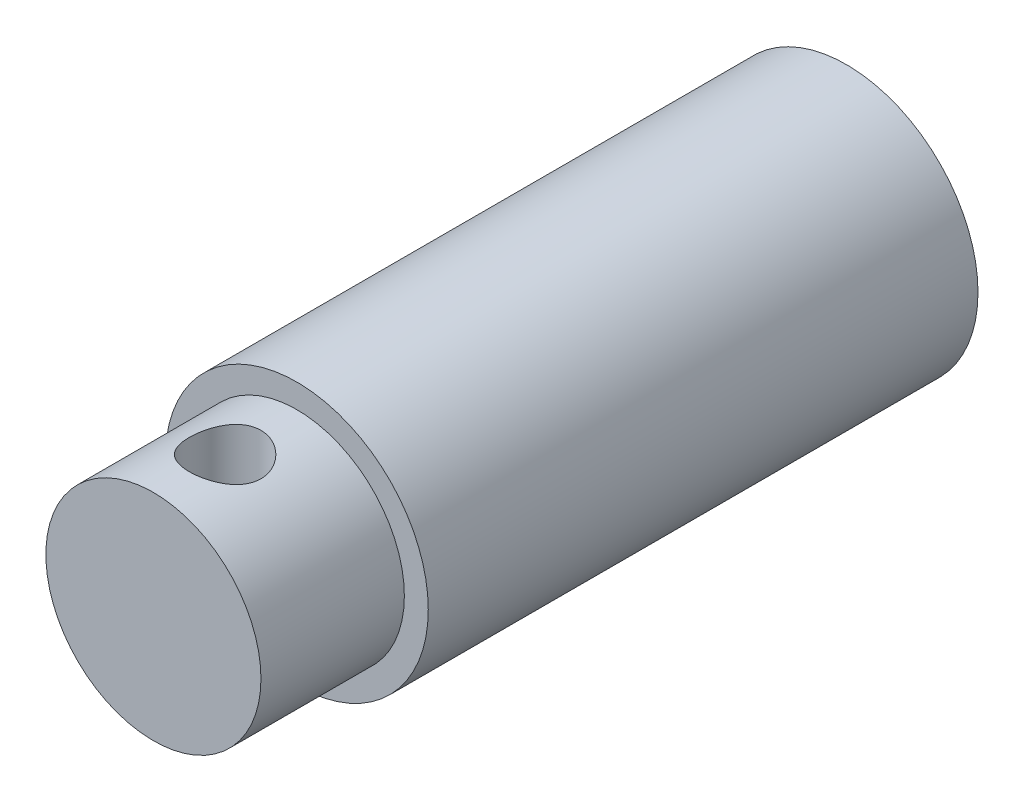
ISO-10303-21;
HEADER;
FILE_DESCRIPTION(('STEP AP214'),'2;1');
FILE_NAME('part.step','',(''),(''),'','','');
FILE_SCHEMA(('AUTOMOTIVE_DESIGN { 1 0 10303 214 1 1 1 1 }'));
ENDSEC;
DATA;
#1=APPLICATION_CONTEXT('core data for automotive mechanical design processes');
#2=APPLICATION_PROTOCOL_DEFINITION('international standard','automotive_design',2000,#1);
#3=PRODUCT_CONTEXT('',#1,'mechanical');
#4=PRODUCT('Part','Part','',(#3));
#5=PRODUCT_RELATED_PRODUCT_CATEGORY('part','',(#4));
#6=PRODUCT_DEFINITION_FORMATION('','',#4);
#7=PRODUCT_DEFINITION_CONTEXT('part definition',#1,'design');
#8=PRODUCT_DEFINITION('design','',#6,#7);
#9=PRODUCT_DEFINITION_SHAPE('','',#8);
#10=(LENGTH_UNIT() NAMED_UNIT(*) SI_UNIT(.MILLI.,.METRE.));
#11=(NAMED_UNIT(*) PLANE_ANGLE_UNIT() SI_UNIT($,.RADIAN.));
#12=(NAMED_UNIT(*) SI_UNIT($,.STERADIAN.) SOLID_ANGLE_UNIT());
#13=UNCERTAINTY_MEASURE_WITH_UNIT(LENGTH_MEASURE(1.E-05),#10,'distance_accuracy_value','');
#14=(GEOMETRIC_REPRESENTATION_CONTEXT(3) GLOBAL_UNCERTAINTY_ASSIGNED_CONTEXT((#13)) GLOBAL_UNIT_ASSIGNED_CONTEXT((#10,
#11,#12)) REPRESENTATION_CONTEXT('',''));
#15=CARTESIAN_POINT('',(0.,0.,0.));
#16=DIRECTION('',(0.,0.,1.));
#17=DIRECTION('',(1.,0.,0.));
#18=AXIS2_PLACEMENT_3D('',#15,#16,#17);
#19=CARTESIAN_POINT('',(0.,0.,23.));
#20=DIRECTION('',(0.,0.,-1.));
#21=DIRECTION('',(-1.,0.,0.));
#22=AXIS2_PLACEMENT_3D('',#19,#20,#21);
#23=CYLINDRICAL_SURFACE('',#22,5.5);
#24=CARTESIAN_POINT('',(0.,0.,23.));
#25=DIRECTION('',(0.,0.,1.));
#26=DIRECTION('',(1.,0.,0.));
#27=AXIS2_PLACEMENT_3D('',#24,#25,#26);
#28=CIRCLE('',#27,5.5);
#29=CARTESIAN_POINT('',(5.5,0.,23.));
#30=VERTEX_POINT('',#29);
#31=EDGE_CURVE('E49',#30,#30,#28,.T.);
#32=ORIENTED_EDGE('',*,*,#31,.F.);
#33=EDGE_LOOP('',(#32));
#34=FACE_BOUND('',#33,.T.);
#35=CARTESIAN_POINT('',(0.,0.,0.));
#36=DIRECTION('',(0.,0.,1.));
#37=DIRECTION('',(1.,0.,0.));
#38=AXIS2_PLACEMENT_3D('',#35,#36,#37);
#39=CIRCLE('',#38,5.5);
#40=CARTESIAN_POINT('',(5.5,0.,0.));
#41=VERTEX_POINT('',#40);
#42=EDGE_CURVE('E54',#41,#41,#39,.T.);
#43=ORIENTED_EDGE('',*,*,#42,.T.);
#44=EDGE_LOOP('',(#43));
#45=FACE_BOUND('',#44,.T.);
#46=ADVANCED_FACE('F37',(#34,#45),#23,.T.);
#47=CARTESIAN_POINT('',(0.,0.,23.));
#48=DIRECTION('',(0.,0.,1.));
#49=DIRECTION('',(1.,0.,0.));
#50=AXIS2_PLACEMENT_3D('',#47,#48,#49);
#51=PLANE('',#50);
#52=CARTESIAN_POINT('',(0.,0.,23.));
#53=DIRECTION('',(0.,0.,1.));
#54=DIRECTION('',(1.,0.,0.));
#55=AXIS2_PLACEMENT_3D('',#52,#53,#54);
#56=CIRCLE('',#55,4.5);
#57=CARTESIAN_POINT('',(4.5,0.,23.));
#58=VERTEX_POINT('',#57);
#59=EDGE_CURVE('E10',#58,#58,#56,.T.);
#60=ORIENTED_EDGE('',*,*,#59,.F.);
#61=EDGE_LOOP('',(#60));
#62=FACE_BOUND('',#61,.T.);
#63=ORIENTED_EDGE('',*,*,#31,.T.);
#64=EDGE_LOOP('',(#63));
#65=FACE_BOUND('',#64,.T.);
#66=ADVANCED_FACE('F85',(#62,#65),#51,.T.);
#67=CARTESIAN_POINT('',(0.,0.,0.));
#68=DIRECTION('',(0.,0.,1.));
#69=DIRECTION('',(1.,0.,0.));
#70=AXIS2_PLACEMENT_3D('',#67,#68,#69);
#71=PLANE('',#70);
#72=ORIENTED_EDGE('',*,*,#42,.F.);
#73=EDGE_LOOP('',(#72));
#74=FACE_BOUND('',#73,.T.);
#75=ADVANCED_FACE('F81',(#74),#71,.F.);
#76=CARTESIAN_POINT('',(0.,0.,29.));
#77=DIRECTION('',(0.,0.,-1.));
#78=DIRECTION('',(-1.,0.,0.));
#79=AXIS2_PLACEMENT_3D('',#76,#77,#78);
#80=CYLINDRICAL_SURFACE('',#79,4.5);
#81=CARTESIAN_POINT('',(0.,-4.5,27.5));
#82=CARTESIAN_POINT('',(0.0818450443300851,-4.50000022951416,27.5000003805975));
#83=CARTESIAN_POINT('',(0.163687791807825,-4.49774654261317,27.4932796008092));
#84=CARTESIAN_POINT('',(0.324962641309459,-4.48897815304921,27.4666563367742));
#85=CARTESIAN_POINT('',(0.404394492178227,-4.48246300803229,27.4467524840766));
#86=CARTESIAN_POINT('',(0.558499184252665,-4.46587961859664,27.3945211349239));
#87=CARTESIAN_POINT('',(0.633179738829052,-4.4558173159628,27.3622144063111));
#88=CARTESIAN_POINT('',(0.776062405207988,-4.43316668576013,27.2861882407425));
#89=CARTESIAN_POINT('',(0.844263235438059,-4.42057786001667,27.2424665524961));
#90=CARTESIAN_POINT('',(0.9746125125334,-4.39371141664507,27.1432612927119));
#91=CARTESIAN_POINT('',(1.03650555044746,-4.37939334695677,27.0874531486093));
#92=CARTESIAN_POINT('',(1.15024903905313,-4.35090472174682,26.9663492679401));
#93=CARTESIAN_POINT('',(1.20209727823419,-4.33673419935824,26.9010514476072));
#94=CARTESIAN_POINT('',(1.29573741334179,-4.30969998715911,26.7605223272053));
#95=CARTESIAN_POINT('',(1.33719728733155,-4.29688558913532,26.6850593904018));
#96=CARTESIAN_POINT('',(1.40672831081658,-4.27462958127902,26.5277358583122));
#97=CARTESIAN_POINT('',(1.43480354608015,-4.26518694241118,26.4458772242559));
#98=CARTESIAN_POINT('',(1.47581019226375,-4.25116954904066,26.2809901677549));
#99=CARTESIAN_POINT('',(1.48922017240766,-4.24644143654417,26.1980941872664));
#100=CARTESIAN_POINT('',(1.50201168500172,-4.24193484944261,26.0311043687662));
#101=CARTESIAN_POINT('',(1.50139755240708,-4.24215484534095,25.9470109089362));
#102=CARTESIAN_POINT('',(1.48652985555513,-4.2473852251227,25.784095054334));
#103=CARTESIAN_POINT('',(1.47290086975049,-4.25217623801299,25.7052073956215));
#104=CARTESIAN_POINT('',(1.43340924427413,-4.26564986586826,25.5509098705897));
#105=CARTESIAN_POINT('',(1.40754513988781,-4.27433294676161,25.4755004218474));
#106=CARTESIAN_POINT('',(1.34390858709032,-4.29476866696873,25.3288808756128));
#107=CARTESIAN_POINT('',(1.30595107306089,-4.30656848689676,25.2577579617957));
#108=CARTESIAN_POINT('',(1.21933365945471,-4.3318883786359,25.1226936375804));
#109=CARTESIAN_POINT('',(1.17067066854601,-4.34540894685695,25.0587543095999));
#110=CARTESIAN_POINT('',(1.06102399902336,-4.37350993751611,24.9363626027588));
#111=CARTESIAN_POINT('',(0.999529725114468,-4.38810884032264,24.8783709582364));
#112=CARTESIAN_POINT('',(0.867509354955096,-4.41610407580555,24.7734031000049));
#113=CARTESIAN_POINT('',(0.79698239349122,-4.42950029307101,24.7264279427533));
#114=CARTESIAN_POINT('',(0.647921419569399,-4.4537566190669,24.6444555496474));
#115=CARTESIAN_POINT('',(0.569314914624503,-4.46459025012059,24.6095817629889));
#116=CARTESIAN_POINT('',(0.40690362504676,-4.48230850716652,24.5536952390664));
#117=CARTESIAN_POINT('',(0.323100657232428,-4.48919450482319,24.5326776868648));
#118=CARTESIAN_POINT('',(0.156575744293954,-4.49801440607161,24.5059165009665));
#119=CARTESIAN_POINT('',(0.0739643997972672,-4.50015002750592,24.4995502862409));
#120=CARTESIAN_POINT('',(-0.0911626049403577,-4.49983354042241,24.5004990103977));
#121=CARTESIAN_POINT('',(-0.173678278979477,-4.49738220629043,24.5078116399698));
#122=CARTESIAN_POINT('',(-0.333779799456385,-4.48830037075656,24.5354178616039));
#123=CARTESIAN_POINT('',(-0.411439210252267,-4.48179298066788,24.5553293090742));
#124=CARTESIAN_POINT('',(-0.562283937869362,-4.46537770245105,24.6070901667001));
#125=CARTESIAN_POINT('',(-0.635468682762912,-4.45546938070013,24.6389410992017));
#126=CARTESIAN_POINT('',(-0.777432444589911,-4.43293396930935,24.7146056477612));
#127=CARTESIAN_POINT('',(-0.846044938825722,-4.42024222133679,24.7587118899248));
#128=CARTESIAN_POINT('',(-0.975097245203381,-4.39357880874393,24.8572912250202));
#129=CARTESIAN_POINT('',(-1.03553455169337,-4.37960675390741,24.9117674840476));
#130=CARTESIAN_POINT('',(-1.14937876170945,-4.35115271970667,25.0324681265099));
#131=CARTESIAN_POINT('',(-1.20234145386866,-4.33667641631142,25.0991138403903));
#132=CARTESIAN_POINT('',(-1.29638628348536,-4.30949959942063,25.2406573517163));
#133=CARTESIAN_POINT('',(-1.33746832189652,-4.29679910073003,25.3155552179511));
#134=CARTESIAN_POINT('',(-1.40639539562454,-4.27473587687075,25.4715095229348));
#135=CARTESIAN_POINT('',(-1.43426719824753,-4.26536641189468,25.5525531187531));
#136=CARTESIAN_POINT('',(-1.47584200013904,-4.25116248459674,25.7185679750662));
#137=CARTESIAN_POINT('',(-1.48955138243091,-4.24632597935459,25.8035374481065));
#138=CARTESIAN_POINT('',(-1.50191442371601,-4.24196788311266,25.9702956440614));
#139=CARTESIAN_POINT('',(-1.5013053859626,-4.24218600386123,26.0520235104302));
#140=CARTESIAN_POINT('',(-1.48686344017304,-4.24726904735801,26.2141476123831));
#141=CARTESIAN_POINT('',(-1.47303131918788,-4.25213369354042,26.2945439269326));
#142=CARTESIAN_POINT('',(-1.43305771969402,-4.26576786457337,26.4502034945037));
#143=CARTESIAN_POINT('',(-1.40715501902327,-4.27446147033716,26.5255352375067));
#144=CARTESIAN_POINT('',(-1.34396904863962,-4.29474598227703,26.6708411104074));
#145=CARTESIAN_POINT('',(-1.30668325283071,-4.3063375314509,26.740814046782));
#146=CARTESIAN_POINT('',(-1.21989103887514,-4.33174243839069,26.8767255048844));
#147=CARTESIAN_POINT('',(-1.16992236414687,-4.34563067463206,26.9423547528476));
#148=CARTESIAN_POINT('',(-1.05996432470347,-4.37375034424879,27.0645347200763));
#149=CARTESIAN_POINT('',(-0.999972126677222,-4.38798187368558,27.1210828635321));
#150=CARTESIAN_POINT('',(-0.868862335381033,-4.41585045788316,27.2257166184338));
#151=CARTESIAN_POINT('',(-0.797402270249593,-4.42944272701885,27.2733865216265));
#152=CARTESIAN_POINT('',(-0.647036036109936,-4.45388986758918,27.355985643276));
#153=CARTESIAN_POINT('',(-0.568131777198522,-4.46474543861895,27.3909181188831));
#154=CARTESIAN_POINT('',(-0.408740470801463,-4.48208272602813,27.445582448733));
#155=CARTESIAN_POINT('',(-0.328481636514612,-4.48873818633784,27.4659236993951));
#156=CARTESIAN_POINT('',(-0.16548062401537,-4.49769610596333,27.4931304210157));
#157=CARTESIAN_POINT('',(-0.0827391383531192,-4.49999976797857,27.4999996152448));
#158=CARTESIAN_POINT('',(0.,-4.5,27.5));
#159=B_SPLINE_CURVE_WITH_KNOTS('',3,(#81,#82,#83,#84,#85,#86,#87,#88,#89,#90,#91,#92,#93,#94,
#95,#96,#97,#98,#99,#100,#101,#102,#103,#104,#105,#106,#107,#108,#109,#110,#111,#112,#113,#114,
#115,#116,#117,#118,#119,#120,#121,#122,#123,#124,#125,#126,#127,#128,#129,#130,#131,#132,#133,
#134,#135,#136,#137,#138,#139,#140,#141,#142,#143,#144,#145,#146,#147,#148,#149,#150,#151,#152,
#153,#154,#155,#156,#157,#158),.UNSPECIFIED.,.T.,.F.,(4,2,2,2,2,2,2,2,2,2,2,2,2,2,2,2,2,2,2,2,2,
2,2,2,2,2,2,2,2,2,2,2,2,2,2,2,2,2,4),(0.,0.245230659039017,0.490486777901282,0.735334009305412,
0.980229566698651,1.23277026424134,1.48536649931295,1.74522577235206,2.0050056703925,
2.25602888612761,2.50697450981229,2.7464523982692,2.98595896283223,3.22932256732696,
3.47275653837311,3.72889958717051,3.98506718949928,4.24377608475537,4.50239503315813,
4.74980374762755,4.99717069746265,5.23737236967321,5.47760467926156,5.72415599765605,
5.97078271232837,6.22861534321128,6.48645012352496,6.74376020740156,7.00095427058761,
7.24493499096388,7.48890119027064,7.72823380620628,7.96761957263968,8.21745100037708,
8.46735316685669,8.72699491252652,8.98657021728686,9.23454837560722,9.48245799057211),.UNSPECIFIED.);
#160=CARTESIAN_POINT('',(0.,-4.5,27.5));
#161=VERTEX_POINT('',#160);
#162=EDGE_CURVE('E40',#161,#161,#159,.T.);
#163=ORIENTED_EDGE('',*,*,#162,.T.);
#164=EDGE_LOOP('',(#163));
#165=FACE_BOUND('',#164,.T.);
#166=CARTESIAN_POINT('',(0.,4.5,27.5));
#167=CARTESIAN_POINT('',(-0.0818450443300851,4.50000022951416,27.5000003805975));
#168=CARTESIAN_POINT('',(-0.163687791807825,4.49774654261317,27.4932796008092));
#169=CARTESIAN_POINT('',(-0.324962641309459,4.48897815304921,27.4666563367742));
#170=CARTESIAN_POINT('',(-0.404394492178227,4.48246300803229,27.4467524840766));
#171=CARTESIAN_POINT('',(-0.558499184252665,4.46587961859664,27.3945211349239));
#172=CARTESIAN_POINT('',(-0.633179738829052,4.4558173159628,27.3622144063111));
#173=CARTESIAN_POINT('',(-0.776062405207988,4.43316668576013,27.2861882407425));
#174=CARTESIAN_POINT('',(-0.844263235438059,4.42057786001667,27.2424665524961));
#175=CARTESIAN_POINT('',(-0.9746125125334,4.39371141664507,27.1432612927119));
#176=CARTESIAN_POINT('',(-1.03650555044746,4.37939334695677,27.0874531486093));
#177=CARTESIAN_POINT('',(-1.15024903905313,4.35090472174682,26.9663492679401));
#178=CARTESIAN_POINT('',(-1.20209727823419,4.33673419935824,26.9010514476072));
#179=CARTESIAN_POINT('',(-1.29573741334179,4.30969998715911,26.7605223272053));
#180=CARTESIAN_POINT('',(-1.33719728733155,4.29688558913532,26.6850593904018));
#181=CARTESIAN_POINT('',(-1.40672831081658,4.27462958127902,26.5277358583122));
#182=CARTESIAN_POINT('',(-1.43480354608015,4.26518694241118,26.4458772242559));
#183=CARTESIAN_POINT('',(-1.47581019226375,4.25116954904066,26.2809901677549));
#184=CARTESIAN_POINT('',(-1.48922017240766,4.24644143654417,26.1980941872664));
#185=CARTESIAN_POINT('',(-1.50201168500172,4.24193484944261,26.0311043687662));
#186=CARTESIAN_POINT('',(-1.50139755240708,4.24215484534095,25.9470109089362));
#187=CARTESIAN_POINT('',(-1.48652985555513,4.2473852251227,25.784095054334));
#188=CARTESIAN_POINT('',(-1.47290086975049,4.25217623801299,25.7052073956215));
#189=CARTESIAN_POINT('',(-1.43340924427413,4.26564986586826,25.5509098705897));
#190=CARTESIAN_POINT('',(-1.40754513988781,4.27433294676161,25.4755004218474));
#191=CARTESIAN_POINT('',(-1.34390858709032,4.29476866696873,25.3288808756128));
#192=CARTESIAN_POINT('',(-1.30595107306089,4.30656848689676,25.2577579617957));
#193=CARTESIAN_POINT('',(-1.21933365945471,4.3318883786359,25.1226936375804));
#194=CARTESIAN_POINT('',(-1.17067066854601,4.34540894685695,25.0587543095999));
#195=CARTESIAN_POINT('',(-1.06102399902336,4.37350993751611,24.9363626027588));
#196=CARTESIAN_POINT('',(-0.999529725114468,4.38810884032264,24.8783709582364));
#197=CARTESIAN_POINT('',(-0.867509354955096,4.41610407580555,24.7734031000049));
#198=CARTESIAN_POINT('',(-0.79698239349122,4.42950029307101,24.7264279427533));
#199=CARTESIAN_POINT('',(-0.647921419569399,4.4537566190669,24.6444555496474));
#200=CARTESIAN_POINT('',(-0.569314914624503,4.46459025012059,24.6095817629889));
#201=CARTESIAN_POINT('',(-0.40690362504676,4.48230850716652,24.5536952390664));
#202=CARTESIAN_POINT('',(-0.323100657232428,4.48919450482319,24.5326776868648));
#203=CARTESIAN_POINT('',(-0.156575744293954,4.49801440607161,24.5059165009665));
#204=CARTESIAN_POINT('',(-0.0739643997972672,4.50015002750592,24.4995502862409));
#205=CARTESIAN_POINT('',(0.0911626049403577,4.49983354042241,24.5004990103977));
#206=CARTESIAN_POINT('',(0.173678278979477,4.49738220629043,24.5078116399698));
#207=CARTESIAN_POINT('',(0.333779799456385,4.48830037075656,24.5354178616039));
#208=CARTESIAN_POINT('',(0.411439210252267,4.48179298066788,24.5553293090742));
#209=CARTESIAN_POINT('',(0.562283937869362,4.46537770245105,24.6070901667001));
#210=CARTESIAN_POINT('',(0.635468682762912,4.45546938070013,24.6389410992017));
#211=CARTESIAN_POINT('',(0.777432444589911,4.43293396930935,24.7146056477612));
#212=CARTESIAN_POINT('',(0.846044938825722,4.42024222133679,24.7587118899248));
#213=CARTESIAN_POINT('',(0.975097245203381,4.39357880874393,24.8572912250202));
#214=CARTESIAN_POINT('',(1.03553455169337,4.37960675390741,24.9117674840476));
#215=CARTESIAN_POINT('',(1.14937876170945,4.35115271970667,25.0324681265099));
#216=CARTESIAN_POINT('',(1.20234145386866,4.33667641631142,25.0991138403903));
#217=CARTESIAN_POINT('',(1.29638628348536,4.30949959942063,25.2406573517163));
#218=CARTESIAN_POINT('',(1.33746832189652,4.29679910073003,25.3155552179511));
#219=CARTESIAN_POINT('',(1.40639539562454,4.27473587687075,25.4715095229348));
#220=CARTESIAN_POINT('',(1.43426719824753,4.26536641189468,25.5525531187531));
#221=CARTESIAN_POINT('',(1.47584200013904,4.25116248459674,25.7185679750662));
#222=CARTESIAN_POINT('',(1.48955138243091,4.24632597935459,25.8035374481065));
#223=CARTESIAN_POINT('',(1.50191442371601,4.24196788311266,25.9702956440614));
#224=CARTESIAN_POINT('',(1.5013053859626,4.24218600386123,26.0520235104302));
#225=CARTESIAN_POINT('',(1.48686344017304,4.24726904735801,26.2141476123831));
#226=CARTESIAN_POINT('',(1.47303131918788,4.25213369354042,26.2945439269326));
#227=CARTESIAN_POINT('',(1.43305771969402,4.26576786457337,26.4502034945037));
#228=CARTESIAN_POINT('',(1.40715501902327,4.27446147033716,26.5255352375067));
#229=CARTESIAN_POINT('',(1.34396904863962,4.29474598227703,26.6708411104074));
#230=CARTESIAN_POINT('',(1.30668325283071,4.3063375314509,26.740814046782));
#231=CARTESIAN_POINT('',(1.21989103887514,4.33174243839069,26.8767255048844));
#232=CARTESIAN_POINT('',(1.16992236414687,4.34563067463206,26.9423547528476));
#233=CARTESIAN_POINT('',(1.05996432470347,4.37375034424879,27.0645347200763));
#234=CARTESIAN_POINT('',(0.999972126677222,4.38798187368558,27.1210828635321));
#235=CARTESIAN_POINT('',(0.868862335381033,4.41585045788316,27.2257166184338));
#236=CARTESIAN_POINT('',(0.797402270249593,4.42944272701885,27.2733865216265));
#237=CARTESIAN_POINT('',(0.647036036109936,4.45388986758918,27.355985643276));
#238=CARTESIAN_POINT('',(0.568131777198522,4.46474543861895,27.3909181188831));
#239=CARTESIAN_POINT('',(0.408740470801463,4.48208272602813,27.445582448733));
#240=CARTESIAN_POINT('',(0.328481636514612,4.48873818633784,27.4659236993951));
#241=CARTESIAN_POINT('',(0.16548062401537,4.49769610596333,27.4931304210157));
#242=CARTESIAN_POINT('',(0.0827391383531192,4.49999976797857,27.4999996152448));
#243=CARTESIAN_POINT('',(0.,4.5,27.5));
#244=B_SPLINE_CURVE_WITH_KNOTS('',3,(#166,#167,#168,#169,#170,#171,#172,#173,#174,#175,#176,
#177,#178,#179,#180,#181,#182,#183,#184,#185,#186,#187,#188,#189,#190,#191,#192,#193,#194,#195,
#196,#197,#198,#199,#200,#201,#202,#203,#204,#205,#206,#207,#208,#209,#210,#211,#212,#213,#214,
#215,#216,#217,#218,#219,#220,#221,#222,#223,#224,#225,#226,#227,#228,#229,#230,#231,#232,#233,
#234,#235,#236,#237,#238,#239,#240,#241,#242,#243),.UNSPECIFIED.,.T.,.F.,(4,2,2,2,2,2,2,2,2,2,2,
2,2,2,2,2,2,2,2,2,2,2,2,2,2,2,2,2,2,2,2,2,2,2,2,2,2,2,4),(0.,0.245230659039017,
0.490486777901282,0.735334009305412,0.980229566698651,1.23277026424134,1.48536649931295,
1.74522577235206,2.0050056703925,2.25602888612761,2.50697450981229,2.7464523982692,
2.98595896283223,3.22932256732696,3.47275653837311,3.72889958717051,3.98506718949928,
4.24377608475537,4.50239503315813,4.74980374762755,4.99717069746265,5.23737236967321,
5.47760467926156,5.72415599765605,5.97078271232837,6.22861534321128,6.48645012352496,
6.74376020740156,7.00095427058761,7.24493499096388,7.48890119027064,7.72823380620628,
7.96761957263968,8.21745100037708,8.46735316685669,8.72699491252652,8.98657021728686,
9.23454837560722,9.48245799057211),.UNSPECIFIED.);
#245=CARTESIAN_POINT('',(0.,4.5,27.5));
#246=VERTEX_POINT('',#245);
#247=EDGE_CURVE('E60',#246,#246,#244,.T.);
#248=ORIENTED_EDGE('',*,*,#247,.T.);
#249=EDGE_LOOP('',(#248));
#250=FACE_BOUND('',#249,.T.);
#251=CARTESIAN_POINT('',(0.,0.,29.));
#252=DIRECTION('',(0.,0.,1.));
#253=DIRECTION('',(1.,0.,0.));
#254=AXIS2_PLACEMENT_3D('',#251,#252,#253);
#255=CIRCLE('',#254,4.5);
#256=CARTESIAN_POINT('',(4.5,0.,29.));
#257=VERTEX_POINT('',#256);
#258=EDGE_CURVE('E57',#257,#257,#255,.T.);
#259=ORIENTED_EDGE('',*,*,#258,.F.);
#260=EDGE_LOOP('',(#259));
#261=FACE_BOUND('',#260,.T.);
#262=ORIENTED_EDGE('',*,*,#59,.T.);
#263=EDGE_LOOP('',(#262));
#264=FACE_BOUND('',#263,.T.);
#265=ADVANCED_FACE('F65',(#165,#250,#261,#264),#80,.T.);
#266=CARTESIAN_POINT('',(0.,0.,29.));
#267=DIRECTION('',(0.,0.,1.));
#268=DIRECTION('',(1.,0.,0.));
#269=AXIS2_PLACEMENT_3D('',#266,#267,#268);
#270=PLANE('',#269);
#271=ORIENTED_EDGE('',*,*,#258,.T.);
#272=EDGE_LOOP('',(#271));
#273=FACE_BOUND('',#272,.T.);
#274=ADVANCED_FACE('F72',(#273),#270,.T.);
#275=CARTESIAN_POINT('',(0.,-5.5,26.));
#276=DIRECTION('',(0.,1.,0.));
#277=DIRECTION('',(0.,0.,1.));
#278=AXIS2_PLACEMENT_3D('',#275,#276,#277);
#279=CYLINDRICAL_SURFACE('',#278,1.5);
#280=ORIENTED_EDGE('',*,*,#247,.F.);
#281=EDGE_LOOP('',(#280));
#282=FACE_BOUND('',#281,.T.);
#283=ORIENTED_EDGE('',*,*,#162,.F.);
#284=EDGE_LOOP('',(#283));
#285=FACE_BOUND('',#284,.T.);
#286=ADVANCED_FACE('F69',(#282,#285),#279,.F.);
#287=CLOSED_SHELL('',(#46,#66,#75,#265,#274,#286));
#288=MANIFOLD_SOLID_BREP('B2',#287);
#289=ADVANCED_BREP_SHAPE_REPRESENTATION('',(#18,#288),#14);
#290=SHAPE_DEFINITION_REPRESENTATION(#9,#289);
ENDSEC;
END-ISO-10303-21;
